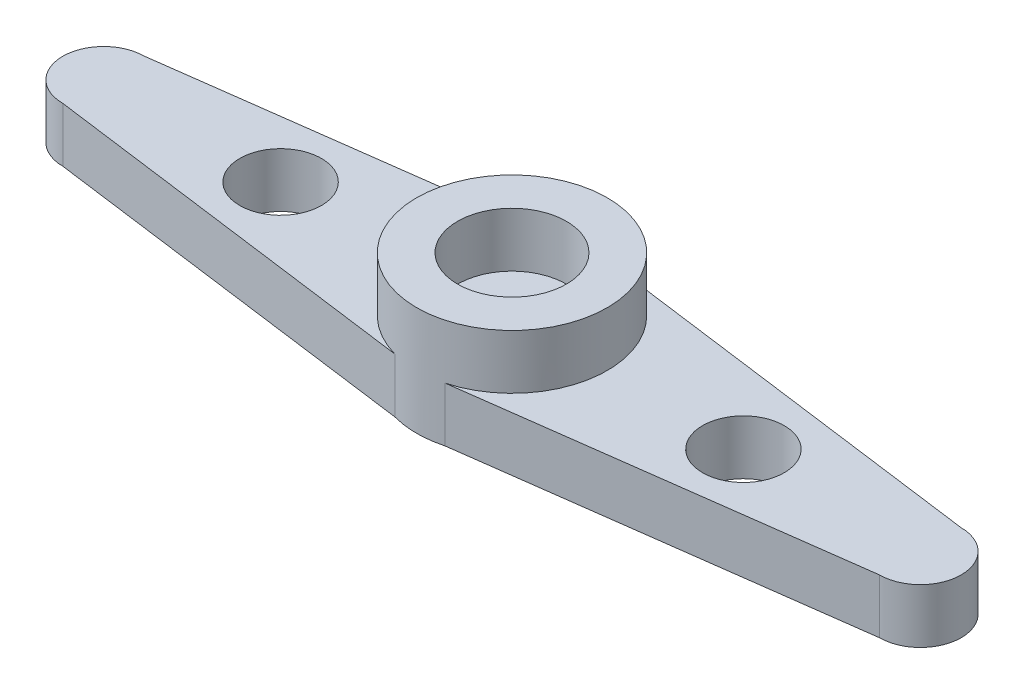
ISO-10303-21;
HEADER;
FILE_DESCRIPTION(('STEP AP214'),'2;1');
FILE_NAME('part.step','',(''),(''),'','','');
FILE_SCHEMA(('AUTOMOTIVE_DESIGN { 1 0 10303 214 1 1 1 1 }'));
ENDSEC;
DATA;
#1=APPLICATION_CONTEXT('core data for automotive mechanical design processes');
#2=APPLICATION_PROTOCOL_DEFINITION('international standard','automotive_design',2000,#1);
#3=PRODUCT_CONTEXT('',#1,'mechanical');
#4=PRODUCT('Part','Part','',(#3));
#5=PRODUCT_RELATED_PRODUCT_CATEGORY('part','',(#4));
#6=PRODUCT_DEFINITION_FORMATION('','',#4);
#7=PRODUCT_DEFINITION_CONTEXT('part definition',#1,'design');
#8=PRODUCT_DEFINITION('design','',#6,#7);
#9=PRODUCT_DEFINITION_SHAPE('','',#8);
#10=(LENGTH_UNIT() NAMED_UNIT(*) SI_UNIT(.MILLI.,.METRE.));
#11=(NAMED_UNIT(*) PLANE_ANGLE_UNIT() SI_UNIT($,.RADIAN.));
#12=(NAMED_UNIT(*) SI_UNIT($,.STERADIAN.) SOLID_ANGLE_UNIT());
#13=UNCERTAINTY_MEASURE_WITH_UNIT(LENGTH_MEASURE(1.E-05),#10,'distance_accuracy_value','');
#14=(GEOMETRIC_REPRESENTATION_CONTEXT(3) GLOBAL_UNCERTAINTY_ASSIGNED_CONTEXT((#13)) GLOBAL_UNIT_ASSIGNED_CONTEXT((#10,
#11,#12)) REPRESENTATION_CONTEXT('',''));
#15=CARTESIAN_POINT('',(0.,0.,0.));
#16=DIRECTION('',(0.,0.,1.));
#17=DIRECTION('',(1.,0.,0.));
#18=AXIS2_PLACEMENT_3D('',#15,#16,#17);
#19=CARTESIAN_POINT('',(0.,4.,0.));
#20=DIRECTION('',(0.,-1.,0.));
#21=DIRECTION('',(0.,0.,-1.));
#22=AXIS2_PLACEMENT_3D('',#19,#20,#21);
#23=CYLINDRICAL_SURFACE('',#22,3.5);
#24=CARTESIAN_POINT('',(0.,0.,0.));
#25=DIRECTION('',(0.,1.,0.));
#26=DIRECTION('',(0.,0.,1.));
#27=AXIS2_PLACEMENT_3D('',#24,#25,#26);
#28=CIRCLE('',#27,3.5);
#29=CARTESIAN_POINT('',(0.917030567685587,0.,-3.37772925764192));
#30=VERTEX_POINT('',#29);
#31=CARTESIAN_POINT('',(-0.917030567685587,0.,-3.37772925764192));
#32=VERTEX_POINT('',#31);
#33=EDGE_CURVE('E170',#30,#32,#28,.T.);
#34=ORIENTED_EDGE('',*,*,#33,.T.);
#35=DIRECTION('',(0.,-1.,0.));
#36=VECTOR('',#35,1.);
#37=CARTESIAN_POINT('',(-0.917030567685585,4.,-3.37772925764192));
#38=LINE('',#37,#36);
#39=CARTESIAN_POINT('',(-0.917030567685598,2.,-3.37772925764192));
#40=VERTEX_POINT('',#39);
#41=EDGE_CURVE('E47',#32,#40,#38,.F.);
#42=ORIENTED_EDGE('',*,*,#41,.T.);
#43=CARTESIAN_POINT('',(0.,2.,0.));
#44=DIRECTION('',(0.,-1.,0.));
#45=DIRECTION('',(0.,0.,-1.));
#46=AXIS2_PLACEMENT_3D('',#43,#44,#45);
#47=CIRCLE('',#46,3.5);
#48=CARTESIAN_POINT('',(-0.917030567685594,2.,3.37772925764192));
#49=VERTEX_POINT('',#48);
#50=EDGE_CURVE('E11',#49,#40,#47,.T.);
#51=ORIENTED_EDGE('',*,*,#50,.F.);
#52=DIRECTION('',(0.,-1.,0.));
#53=VECTOR('',#52,1.);
#54=CARTESIAN_POINT('',(-0.917030567685585,4.,3.37772925764192));
#55=LINE('',#54,#53);
#56=CARTESIAN_POINT('',(-0.917030567685587,0.,3.37772925764192));
#57=VERTEX_POINT('',#56);
#58=EDGE_CURVE('E112',#49,#57,#55,.T.);
#59=ORIENTED_EDGE('',*,*,#58,.T.);
#60=CARTESIAN_POINT('',(0.917030567685585,0.,3.37772925764192));
#61=VERTEX_POINT('',#60);
#62=EDGE_CURVE('E164',#57,#61,#28,.T.);
#63=ORIENTED_EDGE('',*,*,#62,.T.);
#64=DIRECTION('',(0.,-1.,0.));
#65=VECTOR('',#64,1.);
#66=CARTESIAN_POINT('',(0.917030567685585,4.,3.37772925764192));
#67=LINE('',#66,#65);
#68=CARTESIAN_POINT('',(0.917030567685594,2.,3.37772925764192));
#69=VERTEX_POINT('',#68);
#70=EDGE_CURVE('E157',#69,#61,#67,.T.);
#71=ORIENTED_EDGE('',*,*,#70,.F.);
#72=CARTESIAN_POINT('',(0.,2.,0.));
#73=DIRECTION('',(0.,-1.,0.));
#74=DIRECTION('',(0.,0.,-1.));
#75=AXIS2_PLACEMENT_3D('',#72,#73,#74);
#76=CIRCLE('',#75,3.5);
#77=CARTESIAN_POINT('',(0.917030567685598,2.,-3.37772925764192));
#78=VERTEX_POINT('',#77);
#79=EDGE_CURVE('E40',#78,#69,#76,.T.);
#80=ORIENTED_EDGE('',*,*,#79,.F.);
#81=DIRECTION('',(0.,-1.,0.));
#82=VECTOR('',#81,1.);
#83=CARTESIAN_POINT('',(0.917030567685585,4.,-3.37772925764192));
#84=LINE('',#83,#82);
#85=EDGE_CURVE('E154',#30,#78,#84,.F.);
#86=ORIENTED_EDGE('',*,*,#85,.F.);
#87=EDGE_LOOP('',(#34,#42,#51,#59,#63,#71,#80,#86));
#88=FACE_BOUND('',#87,.T.);
#89=CARTESIAN_POINT('',(0.,4.,0.));
#90=DIRECTION('',(0.,1.,0.));
#91=DIRECTION('',(0.,0.,1.));
#92=AXIS2_PLACEMENT_3D('',#89,#90,#91);
#93=CIRCLE('',#92,3.5);
#94=CARTESIAN_POINT('',(0.,4.,3.5));
#95=VERTEX_POINT('',#94);
#96=EDGE_CURVE('E167',#95,#95,#93,.T.);
#97=ORIENTED_EDGE('',*,*,#96,.F.);
#98=EDGE_LOOP('',(#97));
#99=FACE_BOUND('',#98,.T.);
#100=ADVANCED_FACE('F33',(#88,#99),#23,.T.);
#101=CARTESIAN_POINT('',(0.,4.,0.));
#102=DIRECTION('',(0.,1.,0.));
#103=DIRECTION('',(0.,0.,1.));
#104=AXIS2_PLACEMENT_3D('',#101,#102,#103);
#105=PLANE('',#104);
#106=CARTESIAN_POINT('',(0.,4.,0.));
#107=DIRECTION('',(0.,1.,0.));
#108=DIRECTION('',(0.,0.,1.));
#109=AXIS2_PLACEMENT_3D('',#106,#107,#108);
#110=CIRCLE('',#109,2.);
#111=CARTESIAN_POINT('',(0.,4.,2.));
#112=VERTEX_POINT('',#111);
#113=EDGE_CURVE('E160',#112,#112,#110,.T.);
#114=ORIENTED_EDGE('',*,*,#113,.F.);
#115=EDGE_LOOP('',(#114));
#116=FACE_BOUND('',#115,.T.);
#117=ORIENTED_EDGE('',*,*,#96,.T.);
#118=EDGE_LOOP('',(#117));
#119=FACE_BOUND('',#118,.T.);
#120=ADVANCED_FACE('F205',(#116,#119),#105,.T.);
#121=CARTESIAN_POINT('',(0.,0.,0.));
#122=DIRECTION('',(0.,1.,0.));
#123=DIRECTION('',(0.,0.,1.));
#124=AXIS2_PLACEMENT_3D('',#121,#122,#123);
#125=PLANE('',#124);
#126=CARTESIAN_POINT('',(8.5,0.,0.));
#127=DIRECTION('',(0.,1.,0.));
#128=DIRECTION('',(0.,0.,1.));
#129=AXIS2_PLACEMENT_3D('',#126,#127,#128);
#130=CIRCLE('',#129,1.5);
#131=CARTESIAN_POINT('',(8.5,0.,1.5));
#132=VERTEX_POINT('',#131);
#133=EDGE_CURVE('E253',#132,#132,#130,.T.);
#134=ORIENTED_EDGE('',*,*,#133,.T.);
#135=EDGE_LOOP('',(#134));
#136=FACE_BOUND('',#135,.T.);
#137=CARTESIAN_POINT('',(-8.5,0.,0.));
#138=DIRECTION('',(0.,1.,0.));
#139=DIRECTION('',(0.,0.,1.));
#140=AXIS2_PLACEMENT_3D('',#137,#138,#139);
#141=CIRCLE('',#140,1.5);
#142=CARTESIAN_POINT('',(-8.5,0.,1.5));
#143=VERTEX_POINT('',#142);
#144=EDGE_CURVE('E119',#143,#143,#141,.T.);
#145=ORIENTED_EDGE('',*,*,#144,.T.);
#146=EDGE_LOOP('',(#145));
#147=FACE_BOUND('',#146,.T.);
#148=CARTESIAN_POINT('',(-15.,0.,0.));
#149=DIRECTION('',(0.,-1.,0.));
#150=DIRECTION('',(0.,0.,1.));
#151=AXIS2_PLACEMENT_3D('',#148,#149,#150);
#152=CIRCLE('',#151,1.5);
#153=CARTESIAN_POINT('',(-15.,0.,1.5));
#154=VERTEX_POINT('',#153);
#155=CARTESIAN_POINT('',(-15.,0.,-1.5));
#156=VERTEX_POINT('',#155);
#157=EDGE_CURVE('E118',#154,#156,#152,.T.);
#158=ORIENTED_EDGE('',*,*,#157,.T.);
#159=DIRECTION('',(0.991227900682635,0.,-0.132163720091018));
#160=VECTOR('',#159,1.);
#161=CARTESIAN_POINT('',(0.,0.,-3.5));
#162=LINE('',#161,#160);
#163=EDGE_CURVE('E108',#156,#32,#162,.T.);
#164=ORIENTED_EDGE('',*,*,#163,.T.);
#165=ORIENTED_EDGE('',*,*,#33,.F.);
#166=DIRECTION('',(-0.991227900682635,0.,-0.132163720091018));
#167=VECTOR('',#166,1.);
#168=CARTESIAN_POINT('',(0.,0.,-3.5));
#169=LINE('',#168,#167);
#170=CARTESIAN_POINT('',(15.,0.,-1.5));
#171=VERTEX_POINT('',#170);
#172=EDGE_CURVE('E142',#171,#30,#169,.T.);
#173=ORIENTED_EDGE('',*,*,#172,.F.);
#174=CARTESIAN_POINT('',(15.,0.,0.));
#175=DIRECTION('',(0.,1.,0.));
#176=DIRECTION('',(0.,0.,1.));
#177=AXIS2_PLACEMENT_3D('',#174,#175,#176);
#178=CIRCLE('',#177,1.5);
#179=CARTESIAN_POINT('',(15.,0.,1.5));
#180=VERTEX_POINT('',#179);
#181=EDGE_CURVE('E134',#180,#171,#178,.T.);
#182=ORIENTED_EDGE('',*,*,#181,.F.);
#183=DIRECTION('',(0.991227900682635,0.,-0.132163720091018));
#184=VECTOR('',#183,1.);
#185=CARTESIAN_POINT('',(15.,0.,1.5));
#186=LINE('',#185,#184);
#187=EDGE_CURVE('E136',#61,#180,#186,.T.);
#188=ORIENTED_EDGE('',*,*,#187,.F.);
#189=ORIENTED_EDGE('',*,*,#62,.F.);
#190=DIRECTION('',(-0.991227900682635,0.,-0.132163720091018));
#191=VECTOR('',#190,1.);
#192=CARTESIAN_POINT('',(-15.,0.,1.5));
#193=LINE('',#192,#191);
#194=EDGE_CURVE('E102',#57,#154,#193,.T.);
#195=ORIENTED_EDGE('',*,*,#194,.T.);
#196=EDGE_LOOP('',(#158,#164,#165,#173,#182,#188,#189,#195));
#197=FACE_BOUND('',#196,.T.);
#198=ADVANCED_FACE('F187',(#136,#147,#197),#125,.F.);
#199=CARTESIAN_POINT('',(0.,2.,0.));
#200=DIRECTION('',(0.,1.,0.));
#201=DIRECTION('',(0.,0.,1.));
#202=AXIS2_PLACEMENT_3D('',#199,#200,#201);
#203=CYLINDRICAL_SURFACE('',#202,2.);
#204=CARTESIAN_POINT('',(0.,2.,0.));
#205=DIRECTION('',(0.,1.,0.));
#206=DIRECTION('',(0.,0.,1.));
#207=AXIS2_PLACEMENT_3D('',#204,#205,#206);
#208=CIRCLE('',#207,2.);
#209=CARTESIAN_POINT('',(0.,2.,2.));
#210=VERTEX_POINT('',#209);
#211=EDGE_CURVE('E161',#210,#210,#208,.T.);
#212=ORIENTED_EDGE('',*,*,#211,.F.);
#213=EDGE_LOOP('',(#212));
#214=FACE_BOUND('',#213,.T.);
#215=ORIENTED_EDGE('',*,*,#113,.T.);
#216=EDGE_LOOP('',(#215));
#217=FACE_BOUND('',#216,.T.);
#218=ADVANCED_FACE('F214',(#214,#217),#203,.F.);
#219=CARTESIAN_POINT('',(0.,2.,0.));
#220=DIRECTION('',(0.,1.,0.));
#221=DIRECTION('',(0.,0.,1.));
#222=AXIS2_PLACEMENT_3D('',#219,#220,#221);
#223=PLANE('',#222);
#224=ORIENTED_EDGE('',*,*,#211,.T.);
#225=EDGE_LOOP('',(#224));
#226=FACE_BOUND('',#225,.T.);
#227=ADVANCED_FACE('F221',(#226),#223,.T.);
#228=CARTESIAN_POINT('',(0.,2.,0.));
#229=DIRECTION('',(0.,-1.,0.));
#230=DIRECTION('',(0.,0.,-1.));
#231=AXIS2_PLACEMENT_3D('',#228,#229,#230);
#232=PLANE('',#231);
#233=CARTESIAN_POINT('',(8.5,2.,0.));
#234=DIRECTION('',(0.,1.,0.));
#235=DIRECTION('',(0.,0.,1.));
#236=AXIS2_PLACEMENT_3D('',#233,#234,#235);
#237=CIRCLE('',#236,1.5);
#238=CARTESIAN_POINT('',(8.5,2.,1.5));
#239=VERTEX_POINT('',#238);
#240=EDGE_CURVE('E256',#239,#239,#237,.T.);
#241=ORIENTED_EDGE('',*,*,#240,.F.);
#242=EDGE_LOOP('',(#241));
#243=FACE_BOUND('',#242,.T.);
#244=DIRECTION('',(0.991227900682635,0.,-0.132163720091018));
#245=VECTOR('',#244,1.);
#246=CARTESIAN_POINT('',(15.,2.,1.5));
#247=LINE('',#246,#245);
#248=CARTESIAN_POINT('',(15.,2.,1.5));
#249=VERTEX_POINT('',#248);
#250=EDGE_CURVE('E138',#69,#249,#247,.T.);
#251=ORIENTED_EDGE('',*,*,#250,.T.);
#252=CARTESIAN_POINT('',(15.,2.,0.));
#253=DIRECTION('',(0.,1.,0.));
#254=DIRECTION('',(0.,0.,1.));
#255=AXIS2_PLACEMENT_3D('',#252,#253,#254);
#256=CIRCLE('',#255,1.5);
#257=CARTESIAN_POINT('',(15.,2.,-1.5));
#258=VERTEX_POINT('',#257);
#259=EDGE_CURVE('E133',#249,#258,#256,.T.);
#260=ORIENTED_EDGE('',*,*,#259,.T.);
#261=DIRECTION('',(-0.991227900682635,0.,-0.132163720091018));
#262=VECTOR('',#261,1.);
#263=CARTESIAN_POINT('',(0.,2.,-3.5));
#264=LINE('',#263,#262);
#265=EDGE_CURVE('E141',#258,#78,#264,.T.);
#266=ORIENTED_EDGE('',*,*,#265,.T.);
#267=ORIENTED_EDGE('',*,*,#79,.T.);
#268=EDGE_LOOP('',(#251,#260,#266,#267));
#269=FACE_BOUND('',#268,.T.);
#270=ADVANCED_FACE('F174',(#243,#269),#232,.F.);
#271=CARTESIAN_POINT('',(15.,2.,1.5));
#272=DIRECTION('',(-0.132163720091018,0.,-0.991227900682635));
#273=DIRECTION('',(-0.991227900682635,0.,0.132163720091018));
#274=AXIS2_PLACEMENT_3D('',#271,#272,#273);
#275=PLANE('',#274);
#276=ORIENTED_EDGE('',*,*,#250,.F.);
#277=ORIENTED_EDGE('',*,*,#70,.T.);
#278=ORIENTED_EDGE('',*,*,#187,.T.);
#279=DIRECTION('',(0.,-1.,0.));
#280=VECTOR('',#279,1.);
#281=CARTESIAN_POINT('',(15.,2.,1.5));
#282=LINE('',#281,#280);
#283=EDGE_CURVE('E152',#249,#180,#282,.T.);
#284=ORIENTED_EDGE('',*,*,#283,.F.);
#285=EDGE_LOOP('',(#276,#277,#278,#284));
#286=FACE_BOUND('',#285,.T.);
#287=ADVANCED_FACE('F179',(#286),#275,.F.);
#288=CARTESIAN_POINT('',(0.,2.,-3.5));
#289=DIRECTION('',(-0.132163720091018,0.,0.991227900682635));
#290=DIRECTION('',(0.991227900682635,0.,0.132163720091018));
#291=AXIS2_PLACEMENT_3D('',#288,#289,#290);
#292=PLANE('',#291);
#293=ORIENTED_EDGE('',*,*,#172,.T.);
#294=ORIENTED_EDGE('',*,*,#85,.T.);
#295=ORIENTED_EDGE('',*,*,#265,.F.);
#296=DIRECTION('',(0.,-1.,0.));
#297=VECTOR('',#296,1.);
#298=CARTESIAN_POINT('',(15.,2.,-1.5));
#299=LINE('',#298,#297);
#300=EDGE_CURVE('E145',#258,#171,#299,.T.);
#301=ORIENTED_EDGE('',*,*,#300,.T.);
#302=EDGE_LOOP('',(#293,#294,#295,#301));
#303=FACE_BOUND('',#302,.T.);
#304=ADVANCED_FACE('F189',(#303),#292,.F.);
#305=CARTESIAN_POINT('',(15.,0.,0.));
#306=DIRECTION('',(0.,1.,0.));
#307=DIRECTION('',(0.,0.,1.));
#308=AXIS2_PLACEMENT_3D('',#305,#306,#307);
#309=CYLINDRICAL_SURFACE('',#308,1.5);
#310=ORIENTED_EDGE('',*,*,#283,.T.);
#311=ORIENTED_EDGE('',*,*,#181,.T.);
#312=ORIENTED_EDGE('',*,*,#300,.F.);
#313=ORIENTED_EDGE('',*,*,#259,.F.);
#314=EDGE_LOOP('',(#310,#311,#312,#313));
#315=FACE_BOUND('',#314,.T.);
#316=ADVANCED_FACE('F183',(#315),#309,.T.);
#317=CARTESIAN_POINT('',(0.,2.,0.));
#318=DIRECTION('',(0.,-1.,0.));
#319=DIRECTION('',(0.,0.,-1.));
#320=AXIS2_PLACEMENT_3D('',#317,#318,#319);
#321=PLANE('',#320);
#322=CARTESIAN_POINT('',(-8.5,2.,0.));
#323=DIRECTION('',(0.,1.,0.));
#324=DIRECTION('',(0.,0.,1.));
#325=AXIS2_PLACEMENT_3D('',#322,#323,#324);
#326=CIRCLE('',#325,1.5);
#327=CARTESIAN_POINT('',(-8.5,2.,1.5));
#328=VERTEX_POINT('',#327);
#329=EDGE_CURVE('E123',#328,#328,#326,.T.);
#330=ORIENTED_EDGE('',*,*,#329,.F.);
#331=EDGE_LOOP('',(#330));
#332=FACE_BOUND('',#331,.T.);
#333=CARTESIAN_POINT('',(-15.,2.,0.));
#334=DIRECTION('',(0.,-1.,0.));
#335=DIRECTION('',(0.,0.,1.));
#336=AXIS2_PLACEMENT_3D('',#333,#334,#335);
#337=CIRCLE('',#336,1.5);
#338=CARTESIAN_POINT('',(-15.,2.,1.5));
#339=VERTEX_POINT('',#338);
#340=CARTESIAN_POINT('',(-15.,2.,-1.5));
#341=VERTEX_POINT('',#340);
#342=EDGE_CURVE('E99',#339,#341,#337,.T.);
#343=ORIENTED_EDGE('',*,*,#342,.F.);
#344=DIRECTION('',(-0.991227900682635,0.,-0.132163720091018));
#345=VECTOR('',#344,1.);
#346=CARTESIAN_POINT('',(-15.,2.,1.5));
#347=LINE('',#346,#345);
#348=EDGE_CURVE('E101',#49,#339,#347,.T.);
#349=ORIENTED_EDGE('',*,*,#348,.F.);
#350=ORIENTED_EDGE('',*,*,#50,.T.);
#351=DIRECTION('',(0.991227900682635,0.,-0.132163720091018));
#352=VECTOR('',#351,1.);
#353=CARTESIAN_POINT('',(0.,2.,-3.5));
#354=LINE('',#353,#352);
#355=EDGE_CURVE('E94',#341,#40,#354,.T.);
#356=ORIENTED_EDGE('',*,*,#355,.F.);
#357=EDGE_LOOP('',(#343,#349,#350,#356));
#358=FACE_BOUND('',#357,.T.);
#359=ADVANCED_FACE('F96',(#332,#358),#321,.F.);
#360=CARTESIAN_POINT('',(0.,2.,-3.5));
#361=DIRECTION('',(-0.132163720091018,0.,-0.991227900682635));
#362=DIRECTION('',(-0.991227900682635,0.,0.132163720091018));
#363=AXIS2_PLACEMENT_3D('',#360,#361,#362);
#364=PLANE('',#363);
#365=ORIENTED_EDGE('',*,*,#41,.F.);
#366=ORIENTED_EDGE('',*,*,#163,.F.);
#367=DIRECTION('',(0.,-1.,0.));
#368=VECTOR('',#367,1.);
#369=CARTESIAN_POINT('',(-15.,2.,-1.5));
#370=LINE('',#369,#368);
#371=EDGE_CURVE('E105',#341,#156,#370,.T.);
#372=ORIENTED_EDGE('',*,*,#371,.F.);
#373=ORIENTED_EDGE('',*,*,#355,.T.);
#374=EDGE_LOOP('',(#365,#366,#372,#373));
#375=FACE_BOUND('',#374,.T.);
#376=ADVANCED_FACE('F106',(#375),#364,.T.);
#377=CARTESIAN_POINT('',(-15.,2.,1.5));
#378=DIRECTION('',(-0.132163720091018,0.,0.991227900682635));
#379=DIRECTION('',(0.991227900682635,0.,0.132163720091018));
#380=AXIS2_PLACEMENT_3D('',#377,#378,#379);
#381=PLANE('',#380);
#382=ORIENTED_EDGE('',*,*,#58,.F.);
#383=ORIENTED_EDGE('',*,*,#348,.T.);
#384=DIRECTION('',(0.,-1.,0.));
#385=VECTOR('',#384,1.);
#386=CARTESIAN_POINT('',(-15.,2.,1.5));
#387=LINE('',#386,#385);
#388=EDGE_CURVE('E113',#339,#154,#387,.T.);
#389=ORIENTED_EDGE('',*,*,#388,.T.);
#390=ORIENTED_EDGE('',*,*,#194,.F.);
#391=EDGE_LOOP('',(#382,#383,#389,#390));
#392=FACE_BOUND('',#391,.T.);
#393=ADVANCED_FACE('F193',(#392),#381,.T.);
#394=CARTESIAN_POINT('',(-15.,0.,0.));
#395=DIRECTION('',(0.,1.,0.));
#396=DIRECTION('',(0.,0.,1.));
#397=AXIS2_PLACEMENT_3D('',#394,#395,#396);
#398=CYLINDRICAL_SURFACE('',#397,1.5);
#399=ORIENTED_EDGE('',*,*,#388,.F.);
#400=ORIENTED_EDGE('',*,*,#342,.T.);
#401=ORIENTED_EDGE('',*,*,#371,.T.);
#402=ORIENTED_EDGE('',*,*,#157,.F.);
#403=EDGE_LOOP('',(#399,#400,#401,#402));
#404=FACE_BOUND('',#403,.T.);
#405=ADVANCED_FACE('F116',(#404),#398,.T.);
#406=CARTESIAN_POINT('',(-8.5,0.,0.));
#407=DIRECTION('',(0.,1.,0.));
#408=DIRECTION('',(0.,0.,1.));
#409=AXIS2_PLACEMENT_3D('',#406,#407,#408);
#410=CYLINDRICAL_SURFACE('',#409,1.5);
#411=ORIENTED_EDGE('',*,*,#144,.F.);
#412=EDGE_LOOP('',(#411));
#413=FACE_BOUND('',#412,.T.);
#414=ORIENTED_EDGE('',*,*,#329,.T.);
#415=EDGE_LOOP('',(#414));
#416=FACE_BOUND('',#415,.T.);
#417=ADVANCED_FACE('F200',(#413,#416),#410,.F.);
#418=CARTESIAN_POINT('',(8.5,0.,0.));
#419=DIRECTION('',(0.,1.,0.));
#420=DIRECTION('',(0.,0.,1.));
#421=AXIS2_PLACEMENT_3D('',#418,#419,#420);
#422=CYLINDRICAL_SURFACE('',#421,1.5);
#423=ORIENTED_EDGE('',*,*,#133,.F.);
#424=EDGE_LOOP('',(#423));
#425=FACE_BOUND('',#424,.T.);
#426=ORIENTED_EDGE('',*,*,#240,.T.);
#427=EDGE_LOOP('',(#426));
#428=FACE_BOUND('',#427,.T.);
#429=ADVANCED_FACE('F244',(#425,#428),#422,.F.);
#430=CLOSED_SHELL('',(#100,#120,#198,#218,#227,#270,#287,#304,#316,#359,#376,#393,#405,#417,#429));
#431=MANIFOLD_SOLID_BREP('B2',#430);
#432=ADVANCED_BREP_SHAPE_REPRESENTATION('',(#18,#431),#14);
#433=SHAPE_DEFINITION_REPRESENTATION(#9,#432);
ENDSEC;
END-ISO-10303-21;
